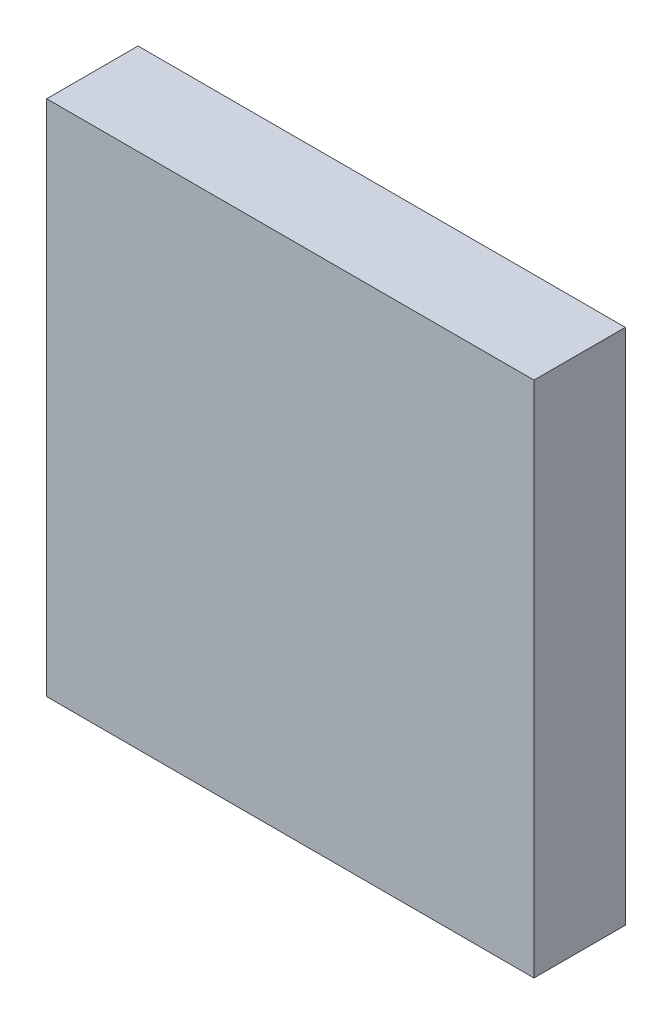
ISO-10303-21;
HEADER;
FILE_DESCRIPTION(('STEP AP214'),'2;1');
FILE_NAME('part.step','',(''),(''),'','','');
FILE_SCHEMA(('AUTOMOTIVE_DESIGN { 1 0 10303 214 1 1 1 1 }'));
ENDSEC;
DATA;
#1=APPLICATION_CONTEXT('core data for automotive mechanical design processes');
#2=APPLICATION_PROTOCOL_DEFINITION('international standard','automotive_design',2000,#1);
#3=PRODUCT_CONTEXT('',#1,'mechanical');
#4=PRODUCT('Part','Part','',(#3));
#5=PRODUCT_RELATED_PRODUCT_CATEGORY('part','',(#4));
#6=PRODUCT_DEFINITION_FORMATION('','',#4);
#7=PRODUCT_DEFINITION_CONTEXT('part definition',#1,'design');
#8=PRODUCT_DEFINITION('design','',#6,#7);
#9=PRODUCT_DEFINITION_SHAPE('','',#8);
#10=(LENGTH_UNIT() NAMED_UNIT(*) SI_UNIT(.MILLI.,.METRE.));
#11=(NAMED_UNIT(*) PLANE_ANGLE_UNIT() SI_UNIT($,.RADIAN.));
#12=(NAMED_UNIT(*) SI_UNIT($,.STERADIAN.) SOLID_ANGLE_UNIT());
#13=UNCERTAINTY_MEASURE_WITH_UNIT(LENGTH_MEASURE(1.E-05),#10,'distance_accuracy_value','');
#14=(GEOMETRIC_REPRESENTATION_CONTEXT(3) GLOBAL_UNCERTAINTY_ASSIGNED_CONTEXT((#13)) GLOBAL_UNIT_ASSIGNED_CONTEXT((#10,
#11,#12)) REPRESENTATION_CONTEXT('',''));
#15=CARTESIAN_POINT('',(0.,0.,0.));
#16=DIRECTION('',(0.,0.,1.));
#17=DIRECTION('',(1.,0.,0.));
#18=AXIS2_PLACEMENT_3D('',#15,#16,#17);
#19=CARTESIAN_POINT('',(50.8,107.95,9.525));
#20=DIRECTION('',(-1.,0.,0.));
#21=DIRECTION('',(0.,0.,1.));
#22=AXIS2_PLACEMENT_3D('',#19,#20,#21);
#23=PLANE('',#22);
#24=DIRECTION('',(0.,0.,-1.));
#25=VECTOR('',#24,1.);
#26=CARTESIAN_POINT('',(50.8,0.,9.525));
#27=LINE('',#26,#25);
#28=CARTESIAN_POINT('',(50.8,0.,9.525));
#29=VERTEX_POINT('',#28);
#30=CARTESIAN_POINT('',(50.8,0.,-9.525));
#31=VERTEX_POINT('',#30);
#32=EDGE_CURVE('E96',#29,#31,#27,.T.);
#33=ORIENTED_EDGE('',*,*,#32,.T.);
#34=DIRECTION('',(0.,-1.,0.));
#35=VECTOR('',#34,1.);
#36=CARTESIAN_POINT('',(50.8,107.95,-9.525));
#37=LINE('',#36,#35);
#38=CARTESIAN_POINT('',(50.8,107.95,-9.525));
#39=VERTEX_POINT('',#38);
#40=EDGE_CURVE('E11',#39,#31,#37,.T.);
#41=ORIENTED_EDGE('',*,*,#40,.F.);
#42=DIRECTION('',(0.,0.,-1.));
#43=VECTOR('',#42,1.);
#44=CARTESIAN_POINT('',(50.8,107.95,9.525));
#45=LINE('',#44,#43);
#46=CARTESIAN_POINT('',(50.8,107.95,9.525));
#47=VERTEX_POINT('',#46);
#48=EDGE_CURVE('E84',#47,#39,#45,.T.);
#49=ORIENTED_EDGE('',*,*,#48,.F.);
#50=DIRECTION('',(0.,-1.,0.));
#51=VECTOR('',#50,1.);
#52=CARTESIAN_POINT('',(50.8,107.95,9.525));
#53=LINE('',#52,#51);
#54=EDGE_CURVE('E92',#47,#29,#53,.T.);
#55=ORIENTED_EDGE('',*,*,#54,.T.);
#56=EDGE_LOOP('',(#33,#41,#49,#55));
#57=FACE_BOUND('',#56,.T.);
#58=ADVANCED_FACE('F33',(#57),#23,.F.);
#59=CARTESIAN_POINT('',(-50.8,107.95,-9.525));
#60=DIRECTION('',(0.,0.,1.));
#61=DIRECTION('',(1.,0.,0.));
#62=AXIS2_PLACEMENT_3D('',#59,#60,#61);
#63=PLANE('',#62);
#64=DIRECTION('',(-1.,0.,0.));
#65=VECTOR('',#64,1.);
#66=CARTESIAN_POINT('',(-50.8,0.,-9.525));
#67=LINE('',#66,#65);
#68=CARTESIAN_POINT('',(-50.8,0.,-9.525));
#69=VERTEX_POINT('',#68);
#70=EDGE_CURVE('E88',#31,#69,#67,.T.);
#71=ORIENTED_EDGE('',*,*,#70,.T.);
#72=DIRECTION('',(0.,-1.,0.));
#73=VECTOR('',#72,1.);
#74=CARTESIAN_POINT('',(-50.8,107.95,-9.525));
#75=LINE('',#74,#73);
#76=CARTESIAN_POINT('',(-50.8,107.95,-9.525));
#77=VERTEX_POINT('',#76);
#78=EDGE_CURVE('E41',#77,#69,#75,.T.);
#79=ORIENTED_EDGE('',*,*,#78,.F.);
#80=DIRECTION('',(-1.,0.,0.));
#81=VECTOR('',#80,1.);
#82=CARTESIAN_POINT('',(-50.8,107.95,-9.525));
#83=LINE('',#82,#81);
#84=EDGE_CURVE('E79',#39,#77,#83,.T.);
#85=ORIENTED_EDGE('',*,*,#84,.F.);
#86=ORIENTED_EDGE('',*,*,#40,.T.);
#87=EDGE_LOOP('',(#71,#79,#85,#86));
#88=FACE_BOUND('',#87,.T.);
#89=ADVANCED_FACE('F87',(#88),#63,.F.);
#90=CARTESIAN_POINT('',(-50.8,107.95,9.525));
#91=DIRECTION('',(1.,0.,0.));
#92=DIRECTION('',(0.,0.,-1.));
#93=AXIS2_PLACEMENT_3D('',#90,#91,#92);
#94=PLANE('',#93);
#95=DIRECTION('',(0.,0.,1.));
#96=VECTOR('',#95,1.);
#97=CARTESIAN_POINT('',(-50.8,0.,9.525));
#98=LINE('',#97,#96);
#99=CARTESIAN_POINT('',(-50.8,0.,9.525));
#100=VERTEX_POINT('',#99);
#101=EDGE_CURVE('E66',#69,#100,#98,.T.);
#102=ORIENTED_EDGE('',*,*,#101,.T.);
#103=DIRECTION('',(0.,-1.,0.));
#104=VECTOR('',#103,1.);
#105=CARTESIAN_POINT('',(-50.8,107.95,9.525));
#106=LINE('',#105,#104);
#107=CARTESIAN_POINT('',(-50.8,107.95,9.525));
#108=VERTEX_POINT('',#107);
#109=EDGE_CURVE('E89',#108,#100,#106,.T.);
#110=ORIENTED_EDGE('',*,*,#109,.F.);
#111=DIRECTION('',(0.,0.,1.));
#112=VECTOR('',#111,1.);
#113=CARTESIAN_POINT('',(-50.8,107.95,9.525));
#114=LINE('',#113,#112);
#115=EDGE_CURVE('E82',#77,#108,#114,.T.);
#116=ORIENTED_EDGE('',*,*,#115,.F.);
#117=ORIENTED_EDGE('',*,*,#78,.T.);
#118=EDGE_LOOP('',(#102,#110,#116,#117));
#119=FACE_BOUND('',#118,.T.);
#120=ADVANCED_FACE('F90',(#119),#94,.F.);
#121=CARTESIAN_POINT('',(-50.8,107.95,9.525));
#122=DIRECTION('',(0.,0.,-1.));
#123=DIRECTION('',(-1.,0.,0.));
#124=AXIS2_PLACEMENT_3D('',#121,#122,#123);
#125=PLANE('',#124);
#126=DIRECTION('',(1.,0.,0.));
#127=VECTOR('',#126,1.);
#128=CARTESIAN_POINT('',(-50.8,0.,9.525));
#129=LINE('',#128,#127);
#130=EDGE_CURVE('E72',#100,#29,#129,.T.);
#131=ORIENTED_EDGE('',*,*,#130,.T.);
#132=ORIENTED_EDGE('',*,*,#54,.F.);
#133=DIRECTION('',(1.,0.,0.));
#134=VECTOR('',#133,1.);
#135=CARTESIAN_POINT('',(-50.8,107.95,9.525));
#136=LINE('',#135,#134);
#137=EDGE_CURVE('E49',#108,#47,#136,.T.);
#138=ORIENTED_EDGE('',*,*,#137,.F.);
#139=ORIENTED_EDGE('',*,*,#109,.T.);
#140=EDGE_LOOP('',(#131,#132,#138,#139));
#141=FACE_BOUND('',#140,.T.);
#142=ADVANCED_FACE('F103',(#141),#125,.F.);
#143=CARTESIAN_POINT('',(0.,107.95,0.));
#144=DIRECTION('',(0.,-1.,0.));
#145=DIRECTION('',(0.,0.,-1.));
#146=AXIS2_PLACEMENT_3D('',#143,#144,#145);
#147=PLANE('',#146);
#148=ORIENTED_EDGE('',*,*,#48,.T.);
#149=ORIENTED_EDGE('',*,*,#84,.T.);
#150=ORIENTED_EDGE('',*,*,#115,.T.);
#151=ORIENTED_EDGE('',*,*,#137,.T.);
#152=EDGE_LOOP('',(#148,#149,#150,#151));
#153=FACE_BOUND('',#152,.T.);
#154=ADVANCED_FACE('F80',(#153),#147,.F.);
#155=CARTESIAN_POINT('',(0.,0.,0.));
#156=DIRECTION('',(0.,-1.,0.));
#157=DIRECTION('',(0.,0.,-1.));
#158=AXIS2_PLACEMENT_3D('',#155,#156,#157);
#159=PLANE('',#158);
#160=ORIENTED_EDGE('',*,*,#32,.F.);
#161=ORIENTED_EDGE('',*,*,#130,.F.);
#162=ORIENTED_EDGE('',*,*,#101,.F.);
#163=ORIENTED_EDGE('',*,*,#70,.F.);
#164=EDGE_LOOP('',(#160,#161,#162,#163));
#165=FACE_BOUND('',#164,.T.);
#166=ADVANCED_FACE('F106',(#165),#159,.T.);
#167=CLOSED_SHELL('',(#58,#89,#120,#142,#154,#166));
#168=MANIFOLD_SOLID_BREP('B2',#167);
#169=ADVANCED_BREP_SHAPE_REPRESENTATION('',(#18,#168),#14);
#170=SHAPE_DEFINITION_REPRESENTATION(#9,#169);
ENDSEC;
END-ISO-10303-21;
